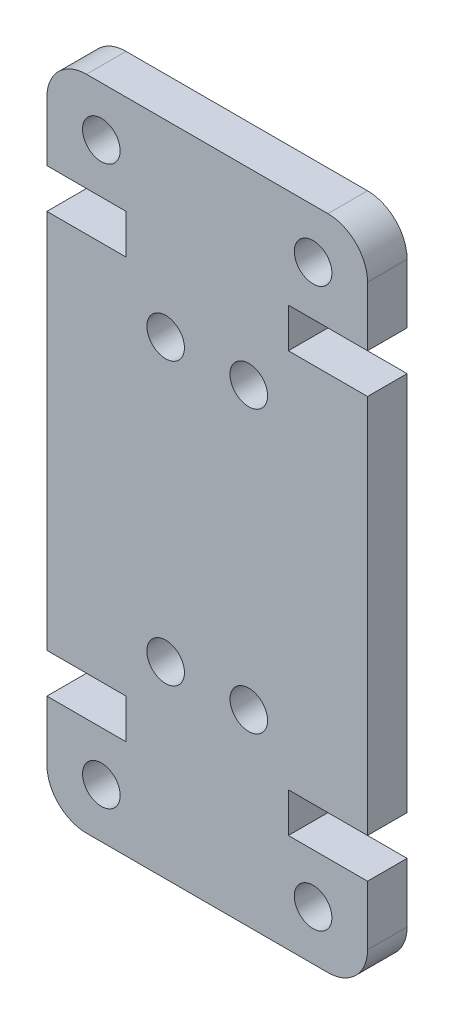
ISO-10303-21;
HEADER;
FILE_DESCRIPTION(('STEP AP214'),'2;1');
FILE_NAME('part.step','',(''),(''),'','','');
FILE_SCHEMA(('AUTOMOTIVE_DESIGN { 1 0 10303 214 1 1 1 1 }'));
ENDSEC;
DATA;
#1=APPLICATION_CONTEXT('core data for automotive mechanical design processes');
#2=APPLICATION_PROTOCOL_DEFINITION('international standard','automotive_design',2000,#1);
#3=PRODUCT_CONTEXT('',#1,'mechanical');
#4=PRODUCT('Part','Part','',(#3));
#5=PRODUCT_RELATED_PRODUCT_CATEGORY('part','',(#4));
#6=PRODUCT_DEFINITION_FORMATION('','',#4);
#7=PRODUCT_DEFINITION_CONTEXT('part definition',#1,'design');
#8=PRODUCT_DEFINITION('design','',#6,#7);
#9=PRODUCT_DEFINITION_SHAPE('','',#8);
#10=(LENGTH_UNIT() NAMED_UNIT(*) SI_UNIT(.MILLI.,.METRE.));
#11=(NAMED_UNIT(*) PLANE_ANGLE_UNIT() SI_UNIT($,.RADIAN.));
#12=(NAMED_UNIT(*) SI_UNIT($,.STERADIAN.) SOLID_ANGLE_UNIT());
#13=UNCERTAINTY_MEASURE_WITH_UNIT(LENGTH_MEASURE(1.E-05),#10,'distance_accuracy_value','');
#14=(GEOMETRIC_REPRESENTATION_CONTEXT(3) GLOBAL_UNCERTAINTY_ASSIGNED_CONTEXT((#13)) GLOBAL_UNIT_ASSIGNED_CONTEXT((#10,
#11,#12)) REPRESENTATION_CONTEXT('',''));
#15=CARTESIAN_POINT('',(0.,0.,0.));
#16=DIRECTION('',(0.,0.,1.));
#17=DIRECTION('',(1.,0.,0.));
#18=AXIS2_PLACEMENT_3D('',#15,#16,#17);
#19=CARTESIAN_POINT('',(2.00000000000001,2.,4.));
#20=DIRECTION('',(0.,0.,1.));
#21=DIRECTION('',(1.,0.,0.));
#22=AXIS2_PLACEMENT_3D('',#19,#20,#21);
#23=PLANE('',#22);
#24=CARTESIAN_POINT('',(10.2,23.7100000000004,4.));
#25=DIRECTION('',(0.,0.,1.));
#26=DIRECTION('',(1.,0.,0.));
#27=AXIS2_PLACEMENT_3D('',#24,#25,#26);
#28=CIRCLE('',#27,0.949999999999999);
#29=CARTESIAN_POINT('',(11.15,23.7100000000004,4.));
#30=VERTEX_POINT('',#29);
#31=EDGE_CURVE('E297',#30,#30,#28,.T.);
#32=ORIENTED_EDGE('',*,*,#31,.F.);
#33=EDGE_LOOP('',(#32));
#34=FACE_BOUND('',#33,.T.);
#35=CARTESIAN_POINT('',(6.,9.49999999999962,4.));
#36=DIRECTION('',(0.,0.,1.));
#37=DIRECTION('',(1.,0.,0.));
#38=AXIS2_PLACEMENT_3D('',#35,#36,#37);
#39=CIRCLE('',#38,0.95);
#40=CARTESIAN_POINT('',(6.95,9.49999999999962,4.));
#41=VERTEX_POINT('',#40);
#42=EDGE_CURVE('E303',#41,#41,#39,.T.);
#43=ORIENTED_EDGE('',*,*,#42,.F.);
#44=EDGE_LOOP('',(#43));
#45=FACE_BOUND('',#44,.T.);
#46=CARTESIAN_POINT('',(2.75000000000003,30.7099999999998,4.));
#47=DIRECTION('',(0.,0.,1.));
#48=DIRECTION('',(-1.,0.,0.));
#49=AXIS2_PLACEMENT_3D('',#46,#47,#48);
#50=CIRCLE('',#49,0.95);
#51=CARTESIAN_POINT('',(1.80000000000003,30.7099999999998,4.));
#52=VERTEX_POINT('',#51);
#53=EDGE_CURVE('E309',#52,#52,#50,.T.);
#54=ORIENTED_EDGE('',*,*,#53,.F.);
#55=EDGE_LOOP('',(#54));
#56=FACE_BOUND('',#55,.T.);
#57=CARTESIAN_POINT('',(13.45,2.50000000000017,4.));
#58=DIRECTION('',(0.,0.,1.));
#59=DIRECTION('',(-1.,0.,0.));
#60=AXIS2_PLACEMENT_3D('',#57,#58,#59);
#61=CIRCLE('',#60,0.949999999999999);
#62=CARTESIAN_POINT('',(12.5,2.50000000000017,4.));
#63=VERTEX_POINT('',#62);
#64=EDGE_CURVE('E315',#63,#63,#61,.T.);
#65=ORIENTED_EDGE('',*,*,#64,.F.);
#66=EDGE_LOOP('',(#65));
#67=FACE_BOUND('',#66,.T.);
#68=DIRECTION('',(1.,0.,0.));
#69=VECTOR('',#68,1.);
#70=CARTESIAN_POINT('',(0.,6.99999999999946,4.));
#71=LINE('',#70,#69);
#72=CARTESIAN_POINT('',(0.,6.99999999999946,4.));
#73=VERTEX_POINT('',#72);
#74=CARTESIAN_POINT('',(4.00000000000001,6.99999999999946,4.));
#75=VERTEX_POINT('',#74);
#76=EDGE_CURVE('E318',#73,#75,#71,.T.);
#77=ORIENTED_EDGE('',*,*,#76,.T.);
#78=DIRECTION('',(0.,-1.,0.));
#79=VECTOR('',#78,1.);
#80=CARTESIAN_POINT('',(4.00000000000001,6.99999999999946,4.));
#81=LINE('',#80,#79);
#82=CARTESIAN_POINT('',(4.,4.99999999999945,4.));
#83=VERTEX_POINT('',#82);
#84=EDGE_CURVE('E285',#75,#83,#81,.T.);
#85=ORIENTED_EDGE('',*,*,#84,.T.);
#86=DIRECTION('',(-1.,0.,0.));
#87=VECTOR('',#86,1.);
#88=CARTESIAN_POINT('',(4.,4.99999999999945,4.));
#89=LINE('',#88,#87);
#90=CARTESIAN_POINT('',(0.,4.99999999999945,4.));
#91=VERTEX_POINT('',#90);
#92=EDGE_CURVE('E281',#83,#91,#89,.T.);
#93=ORIENTED_EDGE('',*,*,#92,.T.);
#94=DIRECTION('',(0.,-1.,0.));
#95=VECTOR('',#94,1.);
#96=CARTESIAN_POINT('',(0.,2.,4.));
#97=LINE('',#96,#95);
#98=CARTESIAN_POINT('',(0.,2.,4.));
#99=VERTEX_POINT('',#98);
#100=EDGE_CURVE('E322',#91,#99,#97,.T.);
#101=ORIENTED_EDGE('',*,*,#100,.T.);
#102=CARTESIAN_POINT('',(2.00000000000001,2.,4.));
#103=DIRECTION('',(0.,0.,1.));
#104=DIRECTION('',(1.,0.,0.));
#105=AXIS2_PLACEMENT_3D('',#102,#103,#104);
#106=CIRCLE('',#105,2.00000000000001);
#107=CARTESIAN_POINT('',(2.00000000000001,0.,4.));
#108=VERTEX_POINT('',#107);
#109=EDGE_CURVE('E324',#99,#108,#106,.T.);
#110=ORIENTED_EDGE('',*,*,#109,.T.);
#111=DIRECTION('',(1.,0.,0.));
#112=VECTOR('',#111,1.);
#113=CARTESIAN_POINT('',(2.00000000000001,0.,4.));
#114=LINE('',#113,#112);
#115=CARTESIAN_POINT('',(14.2,0.,4.));
#116=VERTEX_POINT('',#115);
#117=EDGE_CURVE('E326',#108,#116,#114,.T.);
#118=ORIENTED_EDGE('',*,*,#117,.T.);
#119=CARTESIAN_POINT('',(14.2,2.,4.));
#120=DIRECTION('',(0.,0.,1.));
#121=DIRECTION('',(-1.,0.,0.));
#122=AXIS2_PLACEMENT_3D('',#119,#120,#121);
#123=CIRCLE('',#122,2.);
#124=CARTESIAN_POINT('',(16.2,2.,4.));
#125=VERTEX_POINT('',#124);
#126=EDGE_CURVE('E328',#116,#125,#123,.T.);
#127=ORIENTED_EDGE('',*,*,#126,.T.);
#128=DIRECTION('',(0.,1.,0.));
#129=VECTOR('',#128,1.);
#130=CARTESIAN_POINT('',(16.2,2.,4.));
#131=LINE('',#130,#129);
#132=CARTESIAN_POINT('',(16.2,4.99999999999945,4.));
#133=VERTEX_POINT('',#132);
#134=EDGE_CURVE('E330',#125,#133,#131,.T.);
#135=ORIENTED_EDGE('',*,*,#134,.T.);
#136=DIRECTION('',(-1.,0.,0.));
#137=VECTOR('',#136,1.);
#138=CARTESIAN_POINT('',(12.2,4.99999999999945,4.));
#139=LINE('',#138,#137);
#140=CARTESIAN_POINT('',(12.2,4.99999999999945,4.));
#141=VERTEX_POINT('',#140);
#142=EDGE_CURVE('E332',#133,#141,#139,.T.);
#143=ORIENTED_EDGE('',*,*,#142,.T.);
#144=DIRECTION('',(0.,1.,0.));
#145=VECTOR('',#144,1.);
#146=CARTESIAN_POINT('',(12.2,6.99999999999945,4.));
#147=LINE('',#146,#145);
#148=CARTESIAN_POINT('',(12.2,6.99999999999945,4.));
#149=VERTEX_POINT('',#148);
#150=EDGE_CURVE('E334',#141,#149,#147,.T.);
#151=ORIENTED_EDGE('',*,*,#150,.T.);
#152=DIRECTION('',(1.,0.,0.));
#153=VECTOR('',#152,1.);
#154=CARTESIAN_POINT('',(16.2,6.99999999999945,4.));
#155=LINE('',#154,#153);
#156=CARTESIAN_POINT('',(16.2,6.99999999999945,4.));
#157=VERTEX_POINT('',#156);
#158=EDGE_CURVE('E336',#149,#157,#155,.T.);
#159=ORIENTED_EDGE('',*,*,#158,.T.);
#160=DIRECTION('',(0.,1.,0.));
#161=VECTOR('',#160,1.);
#162=CARTESIAN_POINT('',(16.2,26.2100000000006,4.));
#163=LINE('',#162,#161);
#164=CARTESIAN_POINT('',(16.2,26.2100000000006,4.));
#165=VERTEX_POINT('',#164);
#166=EDGE_CURVE('E338',#157,#165,#163,.T.);
#167=ORIENTED_EDGE('',*,*,#166,.T.);
#168=DIRECTION('',(-1.,0.,0.));
#169=VECTOR('',#168,1.);
#170=CARTESIAN_POINT('',(16.2,26.2100000000006,4.));
#171=LINE('',#170,#169);
#172=CARTESIAN_POINT('',(12.2,26.2100000000006,4.));
#173=VERTEX_POINT('',#172);
#174=EDGE_CURVE('E340',#165,#173,#171,.T.);
#175=ORIENTED_EDGE('',*,*,#174,.T.);
#176=DIRECTION('',(0.,1.,0.));
#177=VECTOR('',#176,1.);
#178=CARTESIAN_POINT('',(12.2,26.2100000000006,4.));
#179=LINE('',#178,#177);
#180=CARTESIAN_POINT('',(12.2,28.2100000000006,4.));
#181=VERTEX_POINT('',#180);
#182=EDGE_CURVE('E342',#173,#181,#179,.T.);
#183=ORIENTED_EDGE('',*,*,#182,.T.);
#184=DIRECTION('',(1.,0.,0.));
#185=VECTOR('',#184,1.);
#186=CARTESIAN_POINT('',(12.2,28.2100000000006,4.));
#187=LINE('',#186,#185);
#188=CARTESIAN_POINT('',(16.2,28.2100000000006,4.));
#189=VERTEX_POINT('',#188);
#190=EDGE_CURVE('E344',#181,#189,#187,.T.);
#191=ORIENTED_EDGE('',*,*,#190,.T.);
#192=DIRECTION('',(0.,1.,0.));
#193=VECTOR('',#192,1.);
#194=CARTESIAN_POINT('',(16.2,31.21,4.));
#195=LINE('',#194,#193);
#196=CARTESIAN_POINT('',(16.2,31.21,4.));
#197=VERTEX_POINT('',#196);
#198=EDGE_CURVE('E346',#189,#197,#195,.T.);
#199=ORIENTED_EDGE('',*,*,#198,.T.);
#200=CARTESIAN_POINT('',(14.2,31.21,4.));
#201=DIRECTION('',(0.,0.,1.));
#202=DIRECTION('',(1.,0.,0.));
#203=AXIS2_PLACEMENT_3D('',#200,#201,#202);
#204=CIRCLE('',#203,2.);
#205=CARTESIAN_POINT('',(14.2,33.21,4.));
#206=VERTEX_POINT('',#205);
#207=EDGE_CURVE('E348',#197,#206,#204,.T.);
#208=ORIENTED_EDGE('',*,*,#207,.T.);
#209=DIRECTION('',(-1.,0.,0.));
#210=VECTOR('',#209,1.);
#211=CARTESIAN_POINT('',(1.99999999999999,33.21,4.));
#212=LINE('',#211,#210);
#213=CARTESIAN_POINT('',(1.99999999999999,33.21,4.));
#214=VERTEX_POINT('',#213);
#215=EDGE_CURVE('E350',#206,#214,#212,.T.);
#216=ORIENTED_EDGE('',*,*,#215,.T.);
#217=CARTESIAN_POINT('',(1.99999999999999,31.21,4.));
#218=DIRECTION('',(0.,0.,1.));
#219=DIRECTION('',(-1.,0.,0.));
#220=AXIS2_PLACEMENT_3D('',#217,#218,#219);
#221=CIRCLE('',#220,2.);
#222=CARTESIAN_POINT('',(0.,31.21,4.));
#223=VERTEX_POINT('',#222);
#224=EDGE_CURVE('E352',#214,#223,#221,.T.);
#225=ORIENTED_EDGE('',*,*,#224,.T.);
#226=DIRECTION('',(0.,-1.,0.));
#227=VECTOR('',#226,1.);
#228=CARTESIAN_POINT('',(0.,31.21,4.));
#229=LINE('',#228,#227);
#230=CARTESIAN_POINT('',(0.,28.2100000000006,4.));
#231=VERTEX_POINT('',#230);
#232=EDGE_CURVE('E220',#223,#231,#229,.T.);
#233=ORIENTED_EDGE('',*,*,#232,.T.);
#234=DIRECTION('',(1.,0.,0.));
#235=VECTOR('',#234,1.);
#236=CARTESIAN_POINT('',(3.99999999999999,28.2100000000006,4.));
#237=LINE('',#236,#235);
#238=CARTESIAN_POINT('',(3.99999999999999,28.2100000000006,4.));
#239=VERTEX_POINT('',#238);
#240=EDGE_CURVE('E355',#231,#239,#237,.T.);
#241=ORIENTED_EDGE('',*,*,#240,.T.);
#242=DIRECTION('',(0.,-1.,0.));
#243=VECTOR('',#242,1.);
#244=CARTESIAN_POINT('',(4.,26.2100000000006,4.));
#245=LINE('',#244,#243);
#246=CARTESIAN_POINT('',(4.,26.2100000000006,4.));
#247=VERTEX_POINT('',#246);
#248=EDGE_CURVE('E357',#239,#247,#245,.T.);
#249=ORIENTED_EDGE('',*,*,#248,.T.);
#250=DIRECTION('',(-1.,0.,0.));
#251=VECTOR('',#250,1.);
#252=CARTESIAN_POINT('',(0.,26.2100000000005,4.));
#253=LINE('',#252,#251);
#254=CARTESIAN_POINT('',(0.,26.2100000000005,4.));
#255=VERTEX_POINT('',#254);
#256=EDGE_CURVE('E359',#247,#255,#253,.T.);
#257=ORIENTED_EDGE('',*,*,#256,.T.);
#258=DIRECTION('',(0.,-1.,0.));
#259=VECTOR('',#258,1.);
#260=CARTESIAN_POINT('',(0.,26.2100000000005,4.));
#261=LINE('',#260,#259);
#262=EDGE_CURVE('E56',#255,#73,#261,.T.);
#263=ORIENTED_EDGE('',*,*,#262,.T.);
#264=EDGE_LOOP('',(#77,#85,#93,#101,#110,#118,#127,#135,#143,#151,#159,#167,#175,#183,#191,#199,
#208,#216,#225,#233,#241,#249,#257,#263));
#265=FACE_BOUND('',#264,.T.);
#266=CARTESIAN_POINT('',(10.2,9.49999999999962,4.));
#267=DIRECTION('',(0.,0.,1.));
#268=DIRECTION('',(-1.,0.,0.));
#269=AXIS2_PLACEMENT_3D('',#266,#267,#268);
#270=CIRCLE('',#269,0.949999999999999);
#271=CARTESIAN_POINT('',(9.25,9.49999999999962,4.));
#272=VERTEX_POINT('',#271);
#273=EDGE_CURVE('E312',#272,#272,#270,.T.);
#274=ORIENTED_EDGE('',*,*,#273,.F.);
#275=EDGE_LOOP('',(#274));
#276=FACE_BOUND('',#275,.T.);
#277=CARTESIAN_POINT('',(5.99999999999999,23.7100000000004,4.));
#278=DIRECTION('',(0.,0.,1.));
#279=DIRECTION('',(-1.,0.,0.));
#280=AXIS2_PLACEMENT_3D('',#277,#278,#279);
#281=CIRCLE('',#280,0.949999999999999);
#282=CARTESIAN_POINT('',(5.05,23.7100000000004,4.));
#283=VERTEX_POINT('',#282);
#284=EDGE_CURVE('E306',#283,#283,#281,.T.);
#285=ORIENTED_EDGE('',*,*,#284,.F.);
#286=EDGE_LOOP('',(#285));
#287=FACE_BOUND('',#286,.T.);
#288=CARTESIAN_POINT('',(2.75000000000004,2.50000000000017,4.));
#289=DIRECTION('',(0.,0.,1.));
#290=DIRECTION('',(1.,0.,0.));
#291=AXIS2_PLACEMENT_3D('',#288,#289,#290);
#292=CIRCLE('',#291,0.95);
#293=CARTESIAN_POINT('',(3.70000000000004,2.50000000000017,4.));
#294=VERTEX_POINT('',#293);
#295=EDGE_CURVE('E300',#294,#294,#292,.T.);
#296=ORIENTED_EDGE('',*,*,#295,.F.);
#297=EDGE_LOOP('',(#296));
#298=FACE_BOUND('',#297,.T.);
#299=CARTESIAN_POINT('',(13.45,30.7099999999998,4.));
#300=DIRECTION('',(0.,0.,1.));
#301=DIRECTION('',(1.,0.,0.));
#302=AXIS2_PLACEMENT_3D('',#299,#300,#301);
#303=CIRCLE('',#302,0.949999999999999);
#304=CARTESIAN_POINT('',(14.4,30.7099999999998,4.));
#305=VERTEX_POINT('',#304);
#306=EDGE_CURVE('E289',#305,#305,#303,.T.);
#307=ORIENTED_EDGE('',*,*,#306,.F.);
#308=EDGE_LOOP('',(#307));
#309=FACE_BOUND('',#308,.T.);
#310=ADVANCED_FACE('F32',(#34,#45,#56,#67,#265,#276,#287,#298,#309),#23,.T.);
#311=CARTESIAN_POINT('',(0.,6.99999999999946,4.));
#312=DIRECTION('',(0.,1.,0.));
#313=DIRECTION('',(0.,0.,1.));
#314=AXIS2_PLACEMENT_3D('',#311,#312,#313);
#315=PLANE('',#314);
#316=DIRECTION('',(0.,0.,-1.));
#317=VECTOR('',#316,1.);
#318=CARTESIAN_POINT('',(0.,6.99999999999946,4.));
#319=LINE('',#318,#317);
#320=CARTESIAN_POINT('',(0.,6.99999999999946,2.));
#321=VERTEX_POINT('',#320);
#322=EDGE_CURVE('E362',#73,#321,#319,.T.);
#323=ORIENTED_EDGE('',*,*,#322,.T.);
#324=DIRECTION('',(1.,0.,0.));
#325=VECTOR('',#324,1.);
#326=CARTESIAN_POINT('',(0.,6.99999999999946,2.));
#327=LINE('',#326,#325);
#328=CARTESIAN_POINT('',(4.00000000000001,6.99999999999946,2.));
#329=VERTEX_POINT('',#328);
#330=EDGE_CURVE('E48',#321,#329,#327,.T.);
#331=ORIENTED_EDGE('',*,*,#330,.T.);
#332=DIRECTION('',(0.,0.,-1.));
#333=VECTOR('',#332,1.);
#334=CARTESIAN_POINT('',(4.00000000000001,6.99999999999946,4.));
#335=LINE('',#334,#333);
#336=EDGE_CURVE('E11',#75,#329,#335,.T.);
#337=ORIENTED_EDGE('',*,*,#336,.F.);
#338=ORIENTED_EDGE('',*,*,#76,.F.);
#339=EDGE_LOOP('',(#323,#331,#337,#338));
#340=FACE_BOUND('',#339,.T.);
#341=ADVANCED_FACE('F34',(#340),#315,.F.);
#342=CARTESIAN_POINT('',(4.00000000000001,6.99999999999946,4.));
#343=DIRECTION('',(1.,0.,0.));
#344=DIRECTION('',(0.,1.,0.));
#345=AXIS2_PLACEMENT_3D('',#342,#343,#344);
#346=PLANE('',#345);
#347=ORIENTED_EDGE('',*,*,#336,.T.);
#348=DIRECTION('',(0.,-1.,0.));
#349=VECTOR('',#348,1.);
#350=CARTESIAN_POINT('',(4.00000000000001,6.99999999999946,2.));
#351=LINE('',#350,#349);
#352=CARTESIAN_POINT('',(4.,4.99999999999945,2.));
#353=VERTEX_POINT('',#352);
#354=EDGE_CURVE('E286',#329,#353,#351,.T.);
#355=ORIENTED_EDGE('',*,*,#354,.T.);
#356=DIRECTION('',(0.,0.,-1.));
#357=VECTOR('',#356,1.);
#358=CARTESIAN_POINT('',(4.,4.99999999999945,4.));
#359=LINE('',#358,#357);
#360=EDGE_CURVE('E41',#83,#353,#359,.T.);
#361=ORIENTED_EDGE('',*,*,#360,.F.);
#362=ORIENTED_EDGE('',*,*,#84,.F.);
#363=EDGE_LOOP('',(#347,#355,#361,#362));
#364=FACE_BOUND('',#363,.T.);
#365=ADVANCED_FACE('F284',(#364),#346,.F.);
#366=CARTESIAN_POINT('',(4.,4.99999999999945,4.));
#367=DIRECTION('',(0.,-1.,0.));
#368=DIRECTION('',(0.,0.,-1.));
#369=AXIS2_PLACEMENT_3D('',#366,#367,#368);
#370=PLANE('',#369);
#371=ORIENTED_EDGE('',*,*,#360,.T.);
#372=DIRECTION('',(-1.,0.,0.));
#373=VECTOR('',#372,1.);
#374=CARTESIAN_POINT('',(4.,4.99999999999945,2.));
#375=LINE('',#374,#373);
#376=CARTESIAN_POINT('',(0.,4.99999999999945,2.));
#377=VERTEX_POINT('',#376);
#378=EDGE_CURVE('E280',#353,#377,#375,.T.);
#379=ORIENTED_EDGE('',*,*,#378,.T.);
#380=DIRECTION('',(0.,0.,-1.));
#381=VECTOR('',#380,1.);
#382=CARTESIAN_POINT('',(0.,4.99999999999945,4.));
#383=LINE('',#382,#381);
#384=EDGE_CURVE('E270',#91,#377,#383,.T.);
#385=ORIENTED_EDGE('',*,*,#384,.F.);
#386=ORIENTED_EDGE('',*,*,#92,.F.);
#387=EDGE_LOOP('',(#371,#379,#385,#386));
#388=FACE_BOUND('',#387,.T.);
#389=ADVANCED_FACE('F278',(#388),#370,.F.);
#390=CARTESIAN_POINT('',(0.,2.,4.));
#391=DIRECTION('',(1.,0.,0.));
#392=DIRECTION('',(0.,0.,-1.));
#393=AXIS2_PLACEMENT_3D('',#390,#391,#392);
#394=PLANE('',#393);
#395=ORIENTED_EDGE('',*,*,#384,.T.);
#396=DIRECTION('',(0.,-1.,0.));
#397=VECTOR('',#396,1.);
#398=CARTESIAN_POINT('',(0.,33.21,2.));
#399=LINE('',#398,#397);
#400=CARTESIAN_POINT('',(0.,2.,2.));
#401=VERTEX_POINT('',#400);
#402=EDGE_CURVE('E207',#377,#401,#399,.T.);
#403=ORIENTED_EDGE('',*,*,#402,.T.);
#404=DIRECTION('',(0.,0.,-1.));
#405=VECTOR('',#404,1.);
#406=CARTESIAN_POINT('',(0.,2.,4.));
#407=LINE('',#406,#405);
#408=EDGE_CURVE('E267',#99,#401,#407,.T.);
#409=ORIENTED_EDGE('',*,*,#408,.F.);
#410=ORIENTED_EDGE('',*,*,#100,.F.);
#411=EDGE_LOOP('',(#395,#403,#409,#410));
#412=FACE_BOUND('',#411,.T.);
#413=ADVANCED_FACE('F425',(#412),#394,.F.);
#414=CARTESIAN_POINT('',(2.00000000000001,2.,4.));
#415=DIRECTION('',(0.,0.,-1.));
#416=DIRECTION('',(-1.,0.,0.));
#417=AXIS2_PLACEMENT_3D('',#414,#415,#416);
#418=CYLINDRICAL_SURFACE('',#417,2.00000000000001);
#419=ORIENTED_EDGE('',*,*,#408,.T.);
#420=CARTESIAN_POINT('',(2.00000000000001,2.,2.));
#421=DIRECTION('',(0.,0.,1.));
#422=DIRECTION('',(1.,0.,0.));
#423=AXIS2_PLACEMENT_3D('',#420,#421,#422);
#424=CIRCLE('',#423,2.00000000000001);
#425=CARTESIAN_POINT('',(2.00000000000001,0.,2.));
#426=VERTEX_POINT('',#425);
#427=EDGE_CURVE('E291',#401,#426,#424,.T.);
#428=ORIENTED_EDGE('',*,*,#427,.T.);
#429=DIRECTION('',(0.,0.,-1.));
#430=VECTOR('',#429,1.);
#431=CARTESIAN_POINT('',(2.00000000000001,0.,4.));
#432=LINE('',#431,#430);
#433=EDGE_CURVE('E264',#108,#426,#432,.T.);
#434=ORIENTED_EDGE('',*,*,#433,.F.);
#435=ORIENTED_EDGE('',*,*,#109,.F.);
#436=EDGE_LOOP('',(#419,#428,#434,#435));
#437=FACE_BOUND('',#436,.T.);
#438=ADVANCED_FACE('F411',(#437),#418,.T.);
#439=CARTESIAN_POINT('',(2.00000000000001,0.,4.));
#440=DIRECTION('',(0.,1.,0.));
#441=DIRECTION('',(-1.,0.,0.));
#442=AXIS2_PLACEMENT_3D('',#439,#440,#441);
#443=PLANE('',#442);
#444=ORIENTED_EDGE('',*,*,#433,.T.);
#445=DIRECTION('',(1.,0.,0.));
#446=VECTOR('',#445,1.);
#447=CARTESIAN_POINT('',(0.,0.,2.));
#448=LINE('',#447,#446);
#449=CARTESIAN_POINT('',(14.2,0.,2.));
#450=VERTEX_POINT('',#449);
#451=EDGE_CURVE('E204',#426,#450,#448,.T.);
#452=ORIENTED_EDGE('',*,*,#451,.T.);
#453=DIRECTION('',(0.,0.,-1.));
#454=VECTOR('',#453,1.);
#455=CARTESIAN_POINT('',(14.2,0.,4.));
#456=LINE('',#455,#454);
#457=EDGE_CURVE('E261',#116,#450,#456,.T.);
#458=ORIENTED_EDGE('',*,*,#457,.F.);
#459=ORIENTED_EDGE('',*,*,#117,.F.);
#460=EDGE_LOOP('',(#444,#452,#458,#459));
#461=FACE_BOUND('',#460,.T.);
#462=ADVANCED_FACE('F418',(#461),#443,.F.);
#463=CARTESIAN_POINT('',(14.2,2.,4.));
#464=DIRECTION('',(0.,0.,-1.));
#465=DIRECTION('',(-1.,0.,0.));
#466=AXIS2_PLACEMENT_3D('',#463,#464,#465);
#467=CYLINDRICAL_SURFACE('',#466,2.);
#468=ORIENTED_EDGE('',*,*,#457,.T.);
#469=CARTESIAN_POINT('',(14.2,2.,2.));
#470=DIRECTION('',(0.,0.,1.));
#471=DIRECTION('',(1.,0.,0.));
#472=AXIS2_PLACEMENT_3D('',#469,#470,#471);
#473=CIRCLE('',#472,2.);
#474=CARTESIAN_POINT('',(16.2,2.,2.));
#475=VERTEX_POINT('',#474);
#476=EDGE_CURVE('E406',#450,#475,#473,.T.);
#477=ORIENTED_EDGE('',*,*,#476,.T.);
#478=DIRECTION('',(0.,0.,-1.));
#479=VECTOR('',#478,1.);
#480=CARTESIAN_POINT('',(16.2,2.,4.));
#481=LINE('',#480,#479);
#482=EDGE_CURVE('E258',#125,#475,#481,.T.);
#483=ORIENTED_EDGE('',*,*,#482,.F.);
#484=ORIENTED_EDGE('',*,*,#126,.F.);
#485=EDGE_LOOP('',(#468,#477,#483,#484));
#486=FACE_BOUND('',#485,.T.);
#487=ADVANCED_FACE('F534',(#486),#467,.T.);
#488=CARTESIAN_POINT('',(16.2,2.,4.));
#489=DIRECTION('',(-1.,0.,0.));
#490=DIRECTION('',(0.,0.,1.));
#491=AXIS2_PLACEMENT_3D('',#488,#489,#490);
#492=PLANE('',#491);
#493=ORIENTED_EDGE('',*,*,#482,.T.);
#494=DIRECTION('',(0.,1.,0.));
#495=VECTOR('',#494,1.);
#496=CARTESIAN_POINT('',(16.2,0.,2.));
#497=LINE('',#496,#495);
#498=CARTESIAN_POINT('',(16.2,4.99999999999945,2.));
#499=VERTEX_POINT('',#498);
#500=EDGE_CURVE('E432',#475,#499,#497,.T.);
#501=ORIENTED_EDGE('',*,*,#500,.T.);
#502=DIRECTION('',(0.,0.,-1.));
#503=VECTOR('',#502,1.);
#504=CARTESIAN_POINT('',(16.2,4.99999999999945,4.));
#505=LINE('',#504,#503);
#506=EDGE_CURVE('E255',#133,#499,#505,.T.);
#507=ORIENTED_EDGE('',*,*,#506,.F.);
#508=ORIENTED_EDGE('',*,*,#134,.F.);
#509=EDGE_LOOP('',(#493,#501,#507,#508));
#510=FACE_BOUND('',#509,.T.);
#511=ADVANCED_FACE('F530',(#510),#492,.F.);
#512=CARTESIAN_POINT('',(12.2,4.99999999999945,4.));
#513=DIRECTION('',(0.,-1.,0.));
#514=DIRECTION('',(0.,0.,-1.));
#515=AXIS2_PLACEMENT_3D('',#512,#513,#514);
#516=PLANE('',#515);
#517=ORIENTED_EDGE('',*,*,#506,.T.);
#518=DIRECTION('',(-1.,0.,0.));
#519=VECTOR('',#518,1.);
#520=CARTESIAN_POINT('',(12.2,4.99999999999945,2.));
#521=LINE('',#520,#519);
#522=CARTESIAN_POINT('',(12.2,4.99999999999945,2.));
#523=VERTEX_POINT('',#522);
#524=EDGE_CURVE('E403',#499,#523,#521,.T.);
#525=ORIENTED_EDGE('',*,*,#524,.T.);
#526=DIRECTION('',(0.,0.,-1.));
#527=VECTOR('',#526,1.);
#528=CARTESIAN_POINT('',(12.2,4.99999999999945,4.));
#529=LINE('',#528,#527);
#530=EDGE_CURVE('E252',#141,#523,#529,.T.);
#531=ORIENTED_EDGE('',*,*,#530,.F.);
#532=ORIENTED_EDGE('',*,*,#142,.F.);
#533=EDGE_LOOP('',(#517,#525,#531,#532));
#534=FACE_BOUND('',#533,.T.);
#535=ADVANCED_FACE('F526',(#534),#516,.F.);
#536=CARTESIAN_POINT('',(12.2,6.99999999999945,4.));
#537=DIRECTION('',(-1.,0.,0.));
#538=DIRECTION('',(0.,0.,1.));
#539=AXIS2_PLACEMENT_3D('',#536,#537,#538);
#540=PLANE('',#539);
#541=ORIENTED_EDGE('',*,*,#530,.T.);
#542=DIRECTION('',(0.,1.,0.));
#543=VECTOR('',#542,1.);
#544=CARTESIAN_POINT('',(12.2,6.99999999999945,2.));
#545=LINE('',#544,#543);
#546=CARTESIAN_POINT('',(12.2,6.99999999999945,2.));
#547=VERTEX_POINT('',#546);
#548=EDGE_CURVE('E400',#523,#547,#545,.T.);
#549=ORIENTED_EDGE('',*,*,#548,.T.);
#550=DIRECTION('',(0.,0.,-1.));
#551=VECTOR('',#550,1.);
#552=CARTESIAN_POINT('',(12.2,6.99999999999945,4.));
#553=LINE('',#552,#551);
#554=EDGE_CURVE('E249',#149,#547,#553,.T.);
#555=ORIENTED_EDGE('',*,*,#554,.F.);
#556=ORIENTED_EDGE('',*,*,#150,.F.);
#557=EDGE_LOOP('',(#541,#549,#555,#556));
#558=FACE_BOUND('',#557,.T.);
#559=ADVANCED_FACE('F522',(#558),#540,.F.);
#560=CARTESIAN_POINT('',(16.2,6.99999999999945,4.));
#561=DIRECTION('',(0.,1.,0.));
#562=DIRECTION('',(-1.,0.,0.));
#563=AXIS2_PLACEMENT_3D('',#560,#561,#562);
#564=PLANE('',#563);
#565=ORIENTED_EDGE('',*,*,#554,.T.);
#566=DIRECTION('',(1.,0.,0.));
#567=VECTOR('',#566,1.);
#568=CARTESIAN_POINT('',(16.2,6.99999999999945,2.));
#569=LINE('',#568,#567);
#570=CARTESIAN_POINT('',(16.2,6.99999999999945,2.));
#571=VERTEX_POINT('',#570);
#572=EDGE_CURVE('E397',#547,#571,#569,.T.);
#573=ORIENTED_EDGE('',*,*,#572,.T.);
#574=DIRECTION('',(0.,0.,-1.));
#575=VECTOR('',#574,1.);
#576=CARTESIAN_POINT('',(16.2,6.99999999999945,4.));
#577=LINE('',#576,#575);
#578=EDGE_CURVE('E246',#157,#571,#577,.T.);
#579=ORIENTED_EDGE('',*,*,#578,.F.);
#580=ORIENTED_EDGE('',*,*,#158,.F.);
#581=EDGE_LOOP('',(#565,#573,#579,#580));
#582=FACE_BOUND('',#581,.T.);
#583=ADVANCED_FACE('F518',(#582),#564,.F.);
#584=CARTESIAN_POINT('',(16.2,26.2100000000006,4.));
#585=DIRECTION('',(-1.,0.,0.));
#586=DIRECTION('',(0.,0.,1.));
#587=AXIS2_PLACEMENT_3D('',#584,#585,#586);
#588=PLANE('',#587);
#589=ORIENTED_EDGE('',*,*,#578,.T.);
#590=CARTESIAN_POINT('',(16.2,26.2100000000006,2.));
#591=VERTEX_POINT('',#590);
#592=EDGE_CURVE('E431',#571,#591,#497,.T.);
#593=ORIENTED_EDGE('',*,*,#592,.T.);
#594=DIRECTION('',(0.,0.,-1.));
#595=VECTOR('',#594,1.);
#596=CARTESIAN_POINT('',(16.2,26.2100000000006,4.));
#597=LINE('',#596,#595);
#598=EDGE_CURVE('E243',#165,#591,#597,.T.);
#599=ORIENTED_EDGE('',*,*,#598,.F.);
#600=ORIENTED_EDGE('',*,*,#166,.F.);
#601=EDGE_LOOP('',(#589,#593,#599,#600));
#602=FACE_BOUND('',#601,.T.);
#603=ADVANCED_FACE('F514',(#602),#588,.F.);
#604=CARTESIAN_POINT('',(16.2,26.2100000000006,4.));
#605=DIRECTION('',(0.,-1.,0.));
#606=DIRECTION('',(0.,0.,-1.));
#607=AXIS2_PLACEMENT_3D('',#604,#605,#606);
#608=PLANE('',#607);
#609=ORIENTED_EDGE('',*,*,#598,.T.);
#610=DIRECTION('',(-1.,0.,0.));
#611=VECTOR('',#610,1.);
#612=CARTESIAN_POINT('',(16.2,26.2100000000006,2.));
#613=LINE('',#612,#611);
#614=CARTESIAN_POINT('',(12.2,26.2100000000006,2.));
#615=VERTEX_POINT('',#614);
#616=EDGE_CURVE('E394',#591,#615,#613,.T.);
#617=ORIENTED_EDGE('',*,*,#616,.T.);
#618=DIRECTION('',(0.,0.,-1.));
#619=VECTOR('',#618,1.);
#620=CARTESIAN_POINT('',(12.2,26.2100000000006,4.));
#621=LINE('',#620,#619);
#622=EDGE_CURVE('E240',#173,#615,#621,.T.);
#623=ORIENTED_EDGE('',*,*,#622,.F.);
#624=ORIENTED_EDGE('',*,*,#174,.F.);
#625=EDGE_LOOP('',(#609,#617,#623,#624));
#626=FACE_BOUND('',#625,.T.);
#627=ADVANCED_FACE('F510',(#626),#608,.F.);
#628=CARTESIAN_POINT('',(12.2,26.2100000000006,4.));
#629=DIRECTION('',(-1.,0.,0.));
#630=DIRECTION('',(0.,-1.,0.));
#631=AXIS2_PLACEMENT_3D('',#628,#629,#630);
#632=PLANE('',#631);
#633=ORIENTED_EDGE('',*,*,#622,.T.);
#634=DIRECTION('',(0.,1.,0.));
#635=VECTOR('',#634,1.);
#636=CARTESIAN_POINT('',(12.2,26.2100000000006,2.));
#637=LINE('',#636,#635);
#638=CARTESIAN_POINT('',(12.2,28.2100000000006,2.));
#639=VERTEX_POINT('',#638);
#640=EDGE_CURVE('E391',#615,#639,#637,.T.);
#641=ORIENTED_EDGE('',*,*,#640,.T.);
#642=DIRECTION('',(0.,0.,-1.));
#643=VECTOR('',#642,1.);
#644=CARTESIAN_POINT('',(12.2,28.2100000000006,4.));
#645=LINE('',#644,#643);
#646=EDGE_CURVE('E237',#181,#639,#645,.T.);
#647=ORIENTED_EDGE('',*,*,#646,.F.);
#648=ORIENTED_EDGE('',*,*,#182,.F.);
#649=EDGE_LOOP('',(#633,#641,#647,#648));
#650=FACE_BOUND('',#649,.T.);
#651=ADVANCED_FACE('F506',(#650),#632,.F.);
#652=CARTESIAN_POINT('',(12.2,28.2100000000006,4.));
#653=DIRECTION('',(0.,1.,0.));
#654=DIRECTION('',(0.,0.,1.));
#655=AXIS2_PLACEMENT_3D('',#652,#653,#654);
#656=PLANE('',#655);
#657=ORIENTED_EDGE('',*,*,#646,.T.);
#658=DIRECTION('',(1.,0.,0.));
#659=VECTOR('',#658,1.);
#660=CARTESIAN_POINT('',(12.2,28.2100000000006,2.));
#661=LINE('',#660,#659);
#662=CARTESIAN_POINT('',(16.2,28.2100000000006,2.));
#663=VERTEX_POINT('',#662);
#664=EDGE_CURVE('E388',#639,#663,#661,.T.);
#665=ORIENTED_EDGE('',*,*,#664,.T.);
#666=DIRECTION('',(0.,0.,-1.));
#667=VECTOR('',#666,1.);
#668=CARTESIAN_POINT('',(16.2,28.2100000000006,4.));
#669=LINE('',#668,#667);
#670=EDGE_CURVE('E234',#189,#663,#669,.T.);
#671=ORIENTED_EDGE('',*,*,#670,.F.);
#672=ORIENTED_EDGE('',*,*,#190,.F.);
#673=EDGE_LOOP('',(#657,#665,#671,#672));
#674=FACE_BOUND('',#673,.T.);
#675=ADVANCED_FACE('F502',(#674),#656,.F.);
#676=CARTESIAN_POINT('',(16.2,31.21,4.));
#677=DIRECTION('',(-1.,0.,0.));
#678=DIRECTION('',(0.,0.,1.));
#679=AXIS2_PLACEMENT_3D('',#676,#677,#678);
#680=PLANE('',#679);
#681=ORIENTED_EDGE('',*,*,#670,.T.);
#682=CARTESIAN_POINT('',(16.2,31.21,2.));
#683=VERTEX_POINT('',#682);
#684=EDGE_CURVE('E428',#663,#683,#497,.T.);
#685=ORIENTED_EDGE('',*,*,#684,.T.);
#686=DIRECTION('',(0.,0.,-1.));
#687=VECTOR('',#686,1.);
#688=CARTESIAN_POINT('',(16.2,31.21,4.));
#689=LINE('',#688,#687);
#690=EDGE_CURVE('E231',#197,#683,#689,.T.);
#691=ORIENTED_EDGE('',*,*,#690,.F.);
#692=ORIENTED_EDGE('',*,*,#198,.F.);
#693=EDGE_LOOP('',(#681,#685,#691,#692));
#694=FACE_BOUND('',#693,.T.);
#695=ADVANCED_FACE('F498',(#694),#680,.F.);
#696=CARTESIAN_POINT('',(14.2,31.21,4.));
#697=DIRECTION('',(0.,0.,-1.));
#698=DIRECTION('',(-1.,0.,0.));
#699=AXIS2_PLACEMENT_3D('',#696,#697,#698);
#700=CYLINDRICAL_SURFACE('',#699,2.);
#701=ORIENTED_EDGE('',*,*,#690,.T.);
#702=CARTESIAN_POINT('',(14.2,31.21,2.));
#703=DIRECTION('',(0.,0.,1.));
#704=DIRECTION('',(1.,0.,0.));
#705=AXIS2_PLACEMENT_3D('',#702,#703,#704);
#706=CIRCLE('',#705,2.);
#707=CARTESIAN_POINT('',(14.2,33.21,2.));
#708=VERTEX_POINT('',#707);
#709=EDGE_CURVE('E217',#683,#708,#706,.T.);
#710=ORIENTED_EDGE('',*,*,#709,.T.);
#711=DIRECTION('',(0.,0.,-1.));
#712=VECTOR('',#711,1.);
#713=CARTESIAN_POINT('',(14.2,33.21,4.));
#714=LINE('',#713,#712);
#715=EDGE_CURVE('E223',#206,#708,#714,.T.);
#716=ORIENTED_EDGE('',*,*,#715,.F.);
#717=ORIENTED_EDGE('',*,*,#207,.F.);
#718=EDGE_LOOP('',(#701,#710,#716,#717));
#719=FACE_BOUND('',#718,.T.);
#720=ADVANCED_FACE('F494',(#719),#700,.T.);
#721=CARTESIAN_POINT('',(1.99999999999999,33.21,4.));
#722=DIRECTION('',(0.,-1.,0.));
#723=DIRECTION('',(0.,0.,-1.));
#724=AXIS2_PLACEMENT_3D('',#721,#722,#723);
#725=PLANE('',#724);
#726=ORIENTED_EDGE('',*,*,#715,.T.);
#727=DIRECTION('',(-1.,0.,0.));
#728=VECTOR('',#727,1.);
#729=CARTESIAN_POINT('',(16.2,33.21,2.));
#730=LINE('',#729,#728);
#731=CARTESIAN_POINT('',(1.99999999999999,33.21,2.));
#732=VERTEX_POINT('',#731);
#733=EDGE_CURVE('E433',#708,#732,#730,.T.);
#734=ORIENTED_EDGE('',*,*,#733,.T.);
#735=DIRECTION('',(0.,0.,-1.));
#736=VECTOR('',#735,1.);
#737=CARTESIAN_POINT('',(1.99999999999999,33.21,4.));
#738=LINE('',#737,#736);
#739=EDGE_CURVE('E216',#214,#732,#738,.T.);
#740=ORIENTED_EDGE('',*,*,#739,.F.);
#741=ORIENTED_EDGE('',*,*,#215,.F.);
#742=EDGE_LOOP('',(#726,#734,#740,#741));
#743=FACE_BOUND('',#742,.T.);
#744=ADVANCED_FACE('F491',(#743),#725,.F.);
#745=CARTESIAN_POINT('',(1.99999999999999,31.21,4.));
#746=DIRECTION('',(0.,0.,-1.));
#747=DIRECTION('',(-1.,0.,0.));
#748=AXIS2_PLACEMENT_3D('',#745,#746,#747);
#749=CYLINDRICAL_SURFACE('',#748,2.);
#750=ORIENTED_EDGE('',*,*,#739,.T.);
#751=CARTESIAN_POINT('',(1.99999999999999,31.21,2.));
#752=DIRECTION('',(0.,0.,1.));
#753=DIRECTION('',(1.,0.,0.));
#754=AXIS2_PLACEMENT_3D('',#751,#752,#753);
#755=CIRCLE('',#754,2.);
#756=CARTESIAN_POINT('',(0.,31.21,2.));
#757=VERTEX_POINT('',#756);
#758=EDGE_CURVE('E196',#732,#757,#755,.T.);
#759=ORIENTED_EDGE('',*,*,#758,.T.);
#760=DIRECTION('',(0.,0.,-1.));
#761=VECTOR('',#760,1.);
#762=CARTESIAN_POINT('',(0.,31.21,4.));
#763=LINE('',#762,#761);
#764=EDGE_CURVE('E213',#223,#757,#763,.T.);
#765=ORIENTED_EDGE('',*,*,#764,.F.);
#766=ORIENTED_EDGE('',*,*,#224,.F.);
#767=EDGE_LOOP('',(#750,#759,#765,#766));
#768=FACE_BOUND('',#767,.T.);
#769=ADVANCED_FACE('F211',(#768),#749,.T.);
#770=CARTESIAN_POINT('',(0.,31.21,4.));
#771=DIRECTION('',(1.,0.,0.));
#772=DIRECTION('',(0.,1.,0.));
#773=AXIS2_PLACEMENT_3D('',#770,#771,#772);
#774=PLANE('',#773);
#775=ORIENTED_EDGE('',*,*,#764,.T.);
#776=CARTESIAN_POINT('',(0.,28.2100000000006,2.));
#777=VERTEX_POINT('',#776);
#778=EDGE_CURVE('E193',#757,#777,#399,.T.);
#779=ORIENTED_EDGE('',*,*,#778,.T.);
#780=DIRECTION('',(0.,0.,-1.));
#781=VECTOR('',#780,1.);
#782=CARTESIAN_POINT('',(0.,28.2100000000006,4.));
#783=LINE('',#782,#781);
#784=EDGE_CURVE('E221',#231,#777,#783,.T.);
#785=ORIENTED_EDGE('',*,*,#784,.F.);
#786=ORIENTED_EDGE('',*,*,#232,.F.);
#787=EDGE_LOOP('',(#775,#779,#785,#786));
#788=FACE_BOUND('',#787,.T.);
#789=ADVANCED_FACE('F219',(#788),#774,.F.);
#790=CARTESIAN_POINT('',(3.99999999999999,28.2100000000006,4.));
#791=DIRECTION('',(0.,1.,0.));
#792=DIRECTION('',(-1.,0.,0.));
#793=AXIS2_PLACEMENT_3D('',#790,#791,#792);
#794=PLANE('',#793);
#795=ORIENTED_EDGE('',*,*,#784,.T.);
#796=DIRECTION('',(1.,0.,0.));
#797=VECTOR('',#796,1.);
#798=CARTESIAN_POINT('',(3.99999999999999,28.2100000000006,2.));
#799=LINE('',#798,#797);
#800=CARTESIAN_POINT('',(3.99999999999999,28.2100000000006,2.));
#801=VERTEX_POINT('',#800);
#802=EDGE_CURVE('E199',#777,#801,#799,.T.);
#803=ORIENTED_EDGE('',*,*,#802,.T.);
#804=DIRECTION('',(0.,0.,-1.));
#805=VECTOR('',#804,1.);
#806=CARTESIAN_POINT('',(3.99999999999999,28.2100000000006,4.));
#807=LINE('',#806,#805);
#808=EDGE_CURVE('E225',#239,#801,#807,.T.);
#809=ORIENTED_EDGE('',*,*,#808,.F.);
#810=ORIENTED_EDGE('',*,*,#240,.F.);
#811=EDGE_LOOP('',(#795,#803,#809,#810));
#812=FACE_BOUND('',#811,.T.);
#813=ADVANCED_FACE('F380',(#812),#794,.F.);
#814=CARTESIAN_POINT('',(4.,26.2100000000006,4.));
#815=DIRECTION('',(1.,0.,0.));
#816=DIRECTION('',(0.,1.,0.));
#817=AXIS2_PLACEMENT_3D('',#814,#815,#816);
#818=PLANE('',#817);
#819=ORIENTED_EDGE('',*,*,#808,.T.);
#820=DIRECTION('',(0.,-1.,0.));
#821=VECTOR('',#820,1.);
#822=CARTESIAN_POINT('',(4.,26.2100000000006,2.));
#823=LINE('',#822,#821);
#824=CARTESIAN_POINT('',(4.,26.2100000000006,2.));
#825=VERTEX_POINT('',#824);
#826=EDGE_CURVE('E377',#801,#825,#823,.T.);
#827=ORIENTED_EDGE('',*,*,#826,.T.);
#828=DIRECTION('',(0.,0.,-1.));
#829=VECTOR('',#828,1.);
#830=CARTESIAN_POINT('',(4.,26.2100000000006,4.));
#831=LINE('',#830,#829);
#832=EDGE_CURVE('E368',#247,#825,#831,.T.);
#833=ORIENTED_EDGE('',*,*,#832,.F.);
#834=ORIENTED_EDGE('',*,*,#248,.F.);
#835=EDGE_LOOP('',(#819,#827,#833,#834));
#836=FACE_BOUND('',#835,.T.);
#837=ADVANCED_FACE('F375',(#836),#818,.F.);
#838=CARTESIAN_POINT('',(0.,26.2100000000005,4.));
#839=DIRECTION('',(0.,-1.,0.));
#840=DIRECTION('',(1.,0.,0.));
#841=AXIS2_PLACEMENT_3D('',#838,#839,#840);
#842=PLANE('',#841);
#843=ORIENTED_EDGE('',*,*,#832,.T.);
#844=DIRECTION('',(-1.,0.,0.));
#845=VECTOR('',#844,1.);
#846=CARTESIAN_POINT('',(0.,26.2100000000005,2.));
#847=LINE('',#846,#845);
#848=CARTESIAN_POINT('',(0.,26.2100000000005,2.));
#849=VERTEX_POINT('',#848);
#850=EDGE_CURVE('E382',#825,#849,#847,.T.);
#851=ORIENTED_EDGE('',*,*,#850,.T.);
#852=DIRECTION('',(0.,0.,-1.));
#853=VECTOR('',#852,1.);
#854=CARTESIAN_POINT('',(0.,26.2100000000005,4.));
#855=LINE('',#854,#853);
#856=EDGE_CURVE('E365',#255,#849,#855,.T.);
#857=ORIENTED_EDGE('',*,*,#856,.F.);
#858=ORIENTED_EDGE('',*,*,#256,.F.);
#859=EDGE_LOOP('',(#843,#851,#857,#858));
#860=FACE_BOUND('',#859,.T.);
#861=ADVANCED_FACE('F458',(#860),#842,.F.);
#862=CARTESIAN_POINT('',(0.,26.2100000000005,4.));
#863=DIRECTION('',(1.,0.,0.));
#864=DIRECTION('',(0.,1.,0.));
#865=AXIS2_PLACEMENT_3D('',#862,#863,#864);
#866=PLANE('',#865);
#867=ORIENTED_EDGE('',*,*,#856,.T.);
#868=EDGE_CURVE('E205',#849,#321,#399,.T.);
#869=ORIENTED_EDGE('',*,*,#868,.T.);
#870=ORIENTED_EDGE('',*,*,#322,.F.);
#871=ORIENTED_EDGE('',*,*,#262,.F.);
#872=EDGE_LOOP('',(#867,#869,#870,#871));
#873=FACE_BOUND('',#872,.T.);
#874=ADVANCED_FACE('F461',(#873),#866,.F.);
#875=CARTESIAN_POINT('',(13.45,2.50000000000017,4.));
#876=DIRECTION('',(0.,0.,-1.));
#877=DIRECTION('',(-1.,0.,0.));
#878=AXIS2_PLACEMENT_3D('',#875,#876,#877);
#879=CYLINDRICAL_SURFACE('',#878,0.949999999999999);
#880=CARTESIAN_POINT('',(13.45,2.50000000000017,2.));
#881=DIRECTION('',(0.,0.,1.));
#882=DIRECTION('',(1.,0.,0.));
#883=AXIS2_PLACEMENT_3D('',#880,#881,#882);
#884=CIRCLE('',#883,0.949999999999999);
#885=CARTESIAN_POINT('',(14.4,2.50000000000017,2.));
#886=VERTEX_POINT('',#885);
#887=EDGE_CURVE('E453',#886,#886,#884,.T.);
#888=ORIENTED_EDGE('',*,*,#887,.F.);
#889=EDGE_LOOP('',(#888));
#890=FACE_BOUND('',#889,.T.);
#891=ORIENTED_EDGE('',*,*,#64,.T.);
#892=EDGE_LOOP('',(#891));
#893=FACE_BOUND('',#892,.T.);
#894=ADVANCED_FACE('F477',(#890,#893),#879,.F.);
#895=CARTESIAN_POINT('',(10.2,9.49999999999962,4.));
#896=DIRECTION('',(0.,0.,-1.));
#897=DIRECTION('',(-1.,0.,0.));
#898=AXIS2_PLACEMENT_3D('',#895,#896,#897);
#899=CYLINDRICAL_SURFACE('',#898,0.949999999999999);
#900=CARTESIAN_POINT('',(10.2,9.49999999999962,2.));
#901=DIRECTION('',(0.,0.,1.));
#902=DIRECTION('',(1.,0.,0.));
#903=AXIS2_PLACEMENT_3D('',#900,#901,#902);
#904=CIRCLE('',#903,0.949999999999999);
#905=CARTESIAN_POINT('',(11.15,9.49999999999962,2.));
#906=VERTEX_POINT('',#905);
#907=EDGE_CURVE('E450',#906,#906,#904,.T.);
#908=ORIENTED_EDGE('',*,*,#907,.F.);
#909=EDGE_LOOP('',(#908));
#910=FACE_BOUND('',#909,.T.);
#911=ORIENTED_EDGE('',*,*,#273,.T.);
#912=EDGE_LOOP('',(#911));
#913=FACE_BOUND('',#912,.T.);
#914=ADVANCED_FACE('F640',(#910,#913),#899,.F.);
#915=CARTESIAN_POINT('',(2.75000000000003,30.7099999999998,4.));
#916=DIRECTION('',(0.,0.,-1.));
#917=DIRECTION('',(-1.,0.,0.));
#918=AXIS2_PLACEMENT_3D('',#915,#916,#917);
#919=CYLINDRICAL_SURFACE('',#918,0.95);
#920=CARTESIAN_POINT('',(2.75000000000003,30.7099999999998,2.));
#921=DIRECTION('',(0.,0.,1.));
#922=DIRECTION('',(1.,0.,0.));
#923=AXIS2_PLACEMENT_3D('',#920,#921,#922);
#924=CIRCLE('',#923,0.95);
#925=CARTESIAN_POINT('',(3.70000000000003,30.7099999999998,2.));
#926=VERTEX_POINT('',#925);
#927=EDGE_CURVE('E447',#926,#926,#924,.T.);
#928=ORIENTED_EDGE('',*,*,#927,.F.);
#929=EDGE_LOOP('',(#928));
#930=FACE_BOUND('',#929,.T.);
#931=ORIENTED_EDGE('',*,*,#53,.T.);
#932=EDGE_LOOP('',(#931));
#933=FACE_BOUND('',#932,.T.);
#934=ADVANCED_FACE('F647',(#930,#933),#919,.F.);
#935=CARTESIAN_POINT('',(5.99999999999999,23.7100000000004,4.));
#936=DIRECTION('',(0.,0.,-1.));
#937=DIRECTION('',(-1.,0.,0.));
#938=AXIS2_PLACEMENT_3D('',#935,#936,#937);
#939=CYLINDRICAL_SURFACE('',#938,0.949999999999999);
#940=CARTESIAN_POINT('',(5.99999999999999,23.7100000000004,2.));
#941=DIRECTION('',(0.,0.,1.));
#942=DIRECTION('',(1.,0.,0.));
#943=AXIS2_PLACEMENT_3D('',#940,#941,#942);
#944=CIRCLE('',#943,0.949999999999999);
#945=CARTESIAN_POINT('',(6.94999999999999,23.7100000000004,2.));
#946=VERTEX_POINT('',#945);
#947=EDGE_CURVE('E444',#946,#946,#944,.T.);
#948=ORIENTED_EDGE('',*,*,#947,.F.);
#949=EDGE_LOOP('',(#948));
#950=FACE_BOUND('',#949,.T.);
#951=ORIENTED_EDGE('',*,*,#284,.T.);
#952=EDGE_LOOP('',(#951));
#953=FACE_BOUND('',#952,.T.);
#954=ADVANCED_FACE('F654',(#950,#953),#939,.F.);
#955=CARTESIAN_POINT('',(6.,9.49999999999962,4.));
#956=DIRECTION('',(0.,0.,-1.));
#957=DIRECTION('',(-1.,0.,0.));
#958=AXIS2_PLACEMENT_3D('',#955,#956,#957);
#959=CYLINDRICAL_SURFACE('',#958,0.95);
#960=CARTESIAN_POINT('',(6.,9.49999999999962,2.));
#961=DIRECTION('',(0.,0.,1.));
#962=DIRECTION('',(1.,0.,0.));
#963=AXIS2_PLACEMENT_3D('',#960,#961,#962);
#964=CIRCLE('',#963,0.95);
#965=CARTESIAN_POINT('',(6.95,9.49999999999962,2.));
#966=VERTEX_POINT('',#965);
#967=EDGE_CURVE('E441',#966,#966,#964,.T.);
#968=ORIENTED_EDGE('',*,*,#967,.F.);
#969=EDGE_LOOP('',(#968));
#970=FACE_BOUND('',#969,.T.);
#971=ORIENTED_EDGE('',*,*,#42,.T.);
#972=EDGE_LOOP('',(#971));
#973=FACE_BOUND('',#972,.T.);
#974=ADVANCED_FACE('F662',(#970,#973),#959,.F.);
#975=CARTESIAN_POINT('',(2.75000000000004,2.50000000000017,4.));
#976=DIRECTION('',(0.,0.,-1.));
#977=DIRECTION('',(-1.,0.,0.));
#978=AXIS2_PLACEMENT_3D('',#975,#976,#977);
#979=CYLINDRICAL_SURFACE('',#978,0.95);
#980=CARTESIAN_POINT('',(2.75000000000004,2.50000000000017,2.));
#981=DIRECTION('',(0.,0.,1.));
#982=DIRECTION('',(1.,0.,0.));
#983=AXIS2_PLACEMENT_3D('',#980,#981,#982);
#984=CIRCLE('',#983,0.95);
#985=CARTESIAN_POINT('',(3.70000000000004,2.50000000000017,2.));
#986=VERTEX_POINT('',#985);
#987=EDGE_CURVE('E438',#986,#986,#984,.T.);
#988=ORIENTED_EDGE('',*,*,#987,.F.);
#989=EDGE_LOOP('',(#988));
#990=FACE_BOUND('',#989,.T.);
#991=ORIENTED_EDGE('',*,*,#295,.T.);
#992=EDGE_LOOP('',(#991));
#993=FACE_BOUND('',#992,.T.);
#994=ADVANCED_FACE('F670',(#990,#993),#979,.F.);
#995=CARTESIAN_POINT('',(10.2,23.7100000000004,4.));
#996=DIRECTION('',(0.,0.,-1.));
#997=DIRECTION('',(-1.,0.,0.));
#998=AXIS2_PLACEMENT_3D('',#995,#996,#997);
#999=CYLINDRICAL_SURFACE('',#998,0.949999999999999);
#1000=CARTESIAN_POINT('',(10.2,23.7100000000004,2.));
#1001=DIRECTION('',(0.,0.,1.));
#1002=DIRECTION('',(1.,0.,0.));
#1003=AXIS2_PLACEMENT_3D('',#1000,#1001,#1002);
#1004=CIRCLE('',#1003,0.949999999999999);
#1005=CARTESIAN_POINT('',(11.15,23.7100000000004,2.));
#1006=VERTEX_POINT('',#1005);
#1007=EDGE_CURVE('E435',#1006,#1006,#1004,.T.);
#1008=ORIENTED_EDGE('',*,*,#1007,.F.);
#1009=EDGE_LOOP('',(#1008));
#1010=FACE_BOUND('',#1009,.T.);
#1011=ORIENTED_EDGE('',*,*,#31,.T.);
#1012=EDGE_LOOP('',(#1011));
#1013=FACE_BOUND('',#1012,.T.);
#1014=ADVANCED_FACE('F678',(#1010,#1013),#999,.F.);
#1015=CARTESIAN_POINT('',(13.45,30.7099999999998,4.));
#1016=DIRECTION('',(0.,0.,-1.));
#1017=DIRECTION('',(-1.,0.,0.));
#1018=AXIS2_PLACEMENT_3D('',#1015,#1016,#1017);
#1019=CYLINDRICAL_SURFACE('',#1018,0.949999999999999);
#1020=CARTESIAN_POINT('',(13.45,30.7099999999998,2.));
#1021=DIRECTION('',(0.,0.,1.));
#1022=DIRECTION('',(1.,0.,0.));
#1023=AXIS2_PLACEMENT_3D('',#1020,#1021,#1022);
#1024=CIRCLE('',#1023,0.949999999999999);
#1025=CARTESIAN_POINT('',(14.4,30.7099999999998,2.));
#1026=VERTEX_POINT('',#1025);
#1027=EDGE_CURVE('E36',#1026,#1026,#1024,.T.);
#1028=ORIENTED_EDGE('',*,*,#1027,.F.);
#1029=EDGE_LOOP('',(#1028));
#1030=FACE_BOUND('',#1029,.T.);
#1031=ORIENTED_EDGE('',*,*,#306,.T.);
#1032=EDGE_LOOP('',(#1031));
#1033=FACE_BOUND('',#1032,.T.);
#1034=ADVANCED_FACE('F686',(#1030,#1033),#1019,.F.);
#1035=CARTESIAN_POINT('',(0.,0.,2.));
#1036=DIRECTION('',(0.,0.,1.));
#1037=DIRECTION('',(1.,0.,0.));
#1038=AXIS2_PLACEMENT_3D('',#1035,#1036,#1037);
#1039=PLANE('',#1038);
#1040=ORIENTED_EDGE('',*,*,#887,.T.);
#1041=EDGE_LOOP('',(#1040));
#1042=FACE_BOUND('',#1041,.T.);
#1043=ORIENTED_EDGE('',*,*,#907,.T.);
#1044=EDGE_LOOP('',(#1043));
#1045=FACE_BOUND('',#1044,.T.);
#1046=ORIENTED_EDGE('',*,*,#927,.T.);
#1047=EDGE_LOOP('',(#1046));
#1048=FACE_BOUND('',#1047,.T.);
#1049=ORIENTED_EDGE('',*,*,#947,.T.);
#1050=EDGE_LOOP('',(#1049));
#1051=FACE_BOUND('',#1050,.T.);
#1052=ORIENTED_EDGE('',*,*,#967,.T.);
#1053=EDGE_LOOP('',(#1052));
#1054=FACE_BOUND('',#1053,.T.);
#1055=ORIENTED_EDGE('',*,*,#987,.T.);
#1056=EDGE_LOOP('',(#1055));
#1057=FACE_BOUND('',#1056,.T.);
#1058=ORIENTED_EDGE('',*,*,#1007,.T.);
#1059=EDGE_LOOP('',(#1058));
#1060=FACE_BOUND('',#1059,.T.);
#1061=ORIENTED_EDGE('',*,*,#1027,.T.);
#1062=EDGE_LOOP('',(#1061));
#1063=FACE_BOUND('',#1062,.T.);
#1064=ORIENTED_EDGE('',*,*,#868,.F.);
#1065=ORIENTED_EDGE('',*,*,#850,.F.);
#1066=ORIENTED_EDGE('',*,*,#826,.F.);
#1067=ORIENTED_EDGE('',*,*,#802,.F.);
#1068=ORIENTED_EDGE('',*,*,#778,.F.);
#1069=ORIENTED_EDGE('',*,*,#758,.F.);
#1070=ORIENTED_EDGE('',*,*,#733,.F.);
#1071=ORIENTED_EDGE('',*,*,#709,.F.);
#1072=ORIENTED_EDGE('',*,*,#684,.F.);
#1073=ORIENTED_EDGE('',*,*,#664,.F.);
#1074=ORIENTED_EDGE('',*,*,#640,.F.);
#1075=ORIENTED_EDGE('',*,*,#616,.F.);
#1076=ORIENTED_EDGE('',*,*,#592,.F.);
#1077=ORIENTED_EDGE('',*,*,#572,.F.);
#1078=ORIENTED_EDGE('',*,*,#548,.F.);
#1079=ORIENTED_EDGE('',*,*,#524,.F.);
#1080=ORIENTED_EDGE('',*,*,#500,.F.);
#1081=ORIENTED_EDGE('',*,*,#476,.F.);
#1082=ORIENTED_EDGE('',*,*,#451,.F.);
#1083=ORIENTED_EDGE('',*,*,#427,.F.);
#1084=ORIENTED_EDGE('',*,*,#402,.F.);
#1085=ORIENTED_EDGE('',*,*,#378,.F.);
#1086=ORIENTED_EDGE('',*,*,#354,.F.);
#1087=ORIENTED_EDGE('',*,*,#330,.F.);
#1088=EDGE_LOOP('',(#1064,#1065,#1066,#1067,#1068,#1069,#1070,#1071,#1072,#1073,#1074,#1075,
#1076,#1077,#1078,#1079,#1080,#1081,#1082,#1083,#1084,#1085,#1086,#1087));
#1089=FACE_BOUND('',#1088,.T.);
#1090=ADVANCED_FACE('F195',(#1042,#1045,#1048,#1051,#1054,#1057,#1060,#1063,#1089),#1039,.F.);
#1091=CLOSED_SHELL('',(#310,#341,#365,#389,#413,#438,#462,#487,#511,#535,#559,#583,#603,#627,
#651,#675,#695,#720,#744,#769,#789,#813,#837,#861,#874,#894,#914,#934,#954,#974,#994,#1014,
#1034,#1090));
#1092=MANIFOLD_SOLID_BREP('B2',#1091);
#1093=ADVANCED_BREP_SHAPE_REPRESENTATION('',(#18,#1092),#14);
#1094=SHAPE_DEFINITION_REPRESENTATION(#9,#1093);
ENDSEC;
END-ISO-10303-21;
